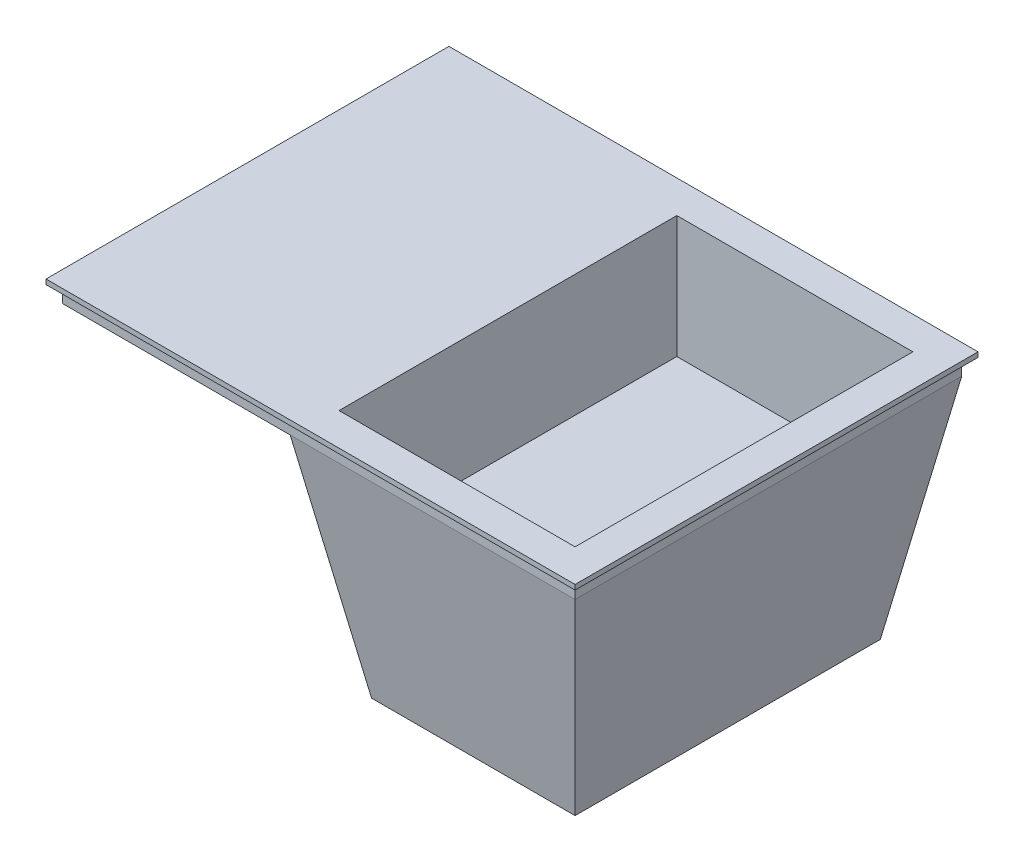
ISO-10303-21;
HEADER;
FILE_DESCRIPTION(('STEP AP214'),'2;1');
FILE_NAME('part.step','',(''),(''),'','','');
FILE_SCHEMA(('AUTOMOTIVE_DESIGN { 1 0 10303 214 1 1 1 1 }'));
ENDSEC;
DATA;
#1=APPLICATION_CONTEXT('core data for automotive mechanical design processes');
#2=APPLICATION_PROTOCOL_DEFINITION('international standard','automotive_design',2000,#1);
#3=PRODUCT_CONTEXT('',#1,'mechanical');
#4=PRODUCT('Part','Part','',(#3));
#5=PRODUCT_RELATED_PRODUCT_CATEGORY('part','',(#4));
#6=PRODUCT_DEFINITION_FORMATION('','',#4);
#7=PRODUCT_DEFINITION_CONTEXT('part definition',#1,'design');
#8=PRODUCT_DEFINITION('design','',#6,#7);
#9=PRODUCT_DEFINITION_SHAPE('','',#8);
#10=(LENGTH_UNIT() NAMED_UNIT(*) SI_UNIT(.MILLI.,.METRE.));
#11=(NAMED_UNIT(*) PLANE_ANGLE_UNIT() SI_UNIT($,.RADIAN.));
#12=(NAMED_UNIT(*) SI_UNIT($,.STERADIAN.) SOLID_ANGLE_UNIT());
#13=UNCERTAINTY_MEASURE_WITH_UNIT(LENGTH_MEASURE(1.E-05),#10,'distance_accuracy_value','');
#14=(GEOMETRIC_REPRESENTATION_CONTEXT(3) GLOBAL_UNCERTAINTY_ASSIGNED_CONTEXT((#13)) GLOBAL_UNIT_ASSIGNED_CONTEXT((#10,
#11,#12)) REPRESENTATION_CONTEXT('',''));
#15=CARTESIAN_POINT('',(0.,0.,0.));
#16=DIRECTION('',(0.,0.,1.));
#17=DIRECTION('',(1.,0.,0.));
#18=AXIS2_PLACEMENT_3D('',#15,#16,#17);
#19=CARTESIAN_POINT('',(-315.,300.,237.5));
#20=DIRECTION('',(1.,0.,0.));
#21=DIRECTION('',(0.,0.,-1.));
#22=AXIS2_PLACEMENT_3D('',#19,#20,#21);
#23=PLANE('',#22);
#24=DIRECTION('',(0.,-1.,0.));
#25=VECTOR('',#24,1.);
#26=CARTESIAN_POINT('',(-315.,300.,-237.5));
#27=LINE('',#26,#25);
#28=CARTESIAN_POINT('',(-315.,300.,-237.5));
#29=VERTEX_POINT('',#28);
#30=CARTESIAN_POINT('',(-315.,280.,-237.5));
#31=VERTEX_POINT('',#30);
#32=EDGE_CURVE('E260',#29,#31,#27,.T.);
#33=ORIENTED_EDGE('',*,*,#32,.T.);
#34=DIRECTION('',(0.,0.,1.));
#35=VECTOR('',#34,1.);
#36=CARTESIAN_POINT('',(-315.,280.,-237.5));
#37=LINE('',#36,#35);
#38=CARTESIAN_POINT('',(-315.,280.,237.5));
#39=VERTEX_POINT('',#38);
#40=EDGE_CURVE('E231',#31,#39,#37,.T.);
#41=ORIENTED_EDGE('',*,*,#40,.T.);
#42=DIRECTION('',(0.,-1.,0.));
#43=VECTOR('',#42,1.);
#44=CARTESIAN_POINT('',(-315.,300.,237.5));
#45=LINE('',#44,#43);
#46=CARTESIAN_POINT('',(-315.,300.,237.5));
#47=VERTEX_POINT('',#46);
#48=EDGE_CURVE('E269',#47,#39,#45,.T.);
#49=ORIENTED_EDGE('',*,*,#48,.F.);
#50=DIRECTION('',(0.,0.,1.));
#51=VECTOR('',#50,1.);
#52=CARTESIAN_POINT('',(-315.,300.,237.5));
#53=LINE('',#52,#51);
#54=EDGE_CURVE('E248',#29,#47,#53,.T.);
#55=ORIENTED_EDGE('',*,*,#54,.F.);
#56=EDGE_LOOP('',(#33,#41,#49,#55));
#57=FACE_BOUND('',#56,.T.);
#58=ADVANCED_FACE('F35',(#57),#23,.F.);
#59=CARTESIAN_POINT('',(315.,300.,237.5));
#60=DIRECTION('',(0.,0.,-1.));
#61=DIRECTION('',(-1.,0.,0.));
#62=AXIS2_PLACEMENT_3D('',#59,#60,#61);
#63=PLANE('',#62);
#64=DIRECTION('',(1.,0.,0.));
#65=VECTOR('',#64,1.);
#66=CARTESIAN_POINT('',(315.,280.,237.5));
#67=LINE('',#66,#65);
#68=CARTESIAN_POINT('',(-34.9999999999999,280.,237.5));
#69=VERTEX_POINT('',#68);
#70=EDGE_CURVE('E234',#39,#69,#67,.T.);
#71=ORIENTED_EDGE('',*,*,#70,.T.);
#72=DIRECTION('',(1.,0.,0.));
#73=VECTOR('',#72,1.);
#74=CARTESIAN_POINT('',(-325.,280.,237.5));
#75=LINE('',#74,#73);
#76=CARTESIAN_POINT('',(315.,280.,237.5));
#77=VERTEX_POINT('',#76);
#78=EDGE_CURVE('E184',#69,#77,#75,.T.);
#79=ORIENTED_EDGE('',*,*,#78,.T.);
#80=DIRECTION('',(0.,-1.,0.));
#81=VECTOR('',#80,1.);
#82=CARTESIAN_POINT('',(315.,300.,237.5));
#83=LINE('',#82,#81);
#84=CARTESIAN_POINT('',(315.,300.,237.5));
#85=VERTEX_POINT('',#84);
#86=EDGE_CURVE('E266',#85,#77,#83,.T.);
#87=ORIENTED_EDGE('',*,*,#86,.F.);
#88=DIRECTION('',(1.,0.,0.));
#89=VECTOR('',#88,1.);
#90=CARTESIAN_POINT('',(315.,300.,237.5));
#91=LINE('',#90,#89);
#92=EDGE_CURVE('E251',#47,#85,#91,.T.);
#93=ORIENTED_EDGE('',*,*,#92,.F.);
#94=ORIENTED_EDGE('',*,*,#48,.T.);
#95=EDGE_LOOP('',(#71,#79,#87,#93,#94));
#96=FACE_BOUND('',#95,.T.);
#97=ADVANCED_FACE('F278',(#96),#63,.F.);
#98=CARTESIAN_POINT('',(315.,300.,237.5));
#99=DIRECTION('',(-1.,0.,0.));
#100=DIRECTION('',(0.,0.,1.));
#101=AXIS2_PLACEMENT_3D('',#98,#99,#100);
#102=PLANE('',#101);
#103=ORIENTED_EDGE('',*,*,#86,.T.);
#104=DIRECTION('',(0.,0.,1.));
#105=VECTOR('',#104,1.);
#106=CARTESIAN_POINT('',(315.,280.,-237.5));
#107=LINE('',#106,#105);
#108=CARTESIAN_POINT('',(315.,280.,-237.5));
#109=VERTEX_POINT('',#108);
#110=EDGE_CURVE('E225',#109,#77,#107,.T.);
#111=ORIENTED_EDGE('',*,*,#110,.F.);
#112=DIRECTION('',(0.,-1.,0.));
#113=VECTOR('',#112,1.);
#114=CARTESIAN_POINT('',(315.,300.,-237.5));
#115=LINE('',#114,#113);
#116=CARTESIAN_POINT('',(315.,300.,-237.5));
#117=VERTEX_POINT('',#116);
#118=EDGE_CURVE('E263',#117,#109,#115,.T.);
#119=ORIENTED_EDGE('',*,*,#118,.F.);
#120=DIRECTION('',(0.,0.,-1.));
#121=VECTOR('',#120,1.);
#122=CARTESIAN_POINT('',(315.,300.,237.5));
#123=LINE('',#122,#121);
#124=EDGE_CURVE('E254',#85,#117,#123,.T.);
#125=ORIENTED_EDGE('',*,*,#124,.F.);
#126=EDGE_LOOP('',(#103,#111,#119,#125));
#127=FACE_BOUND('',#126,.T.);
#128=ADVANCED_FACE('F304',(#127),#102,.F.);
#129=CARTESIAN_POINT('',(315.,300.,-237.5));
#130=DIRECTION('',(0.,0.,1.));
#131=DIRECTION('',(1.,0.,0.));
#132=AXIS2_PLACEMENT_3D('',#129,#130,#131);
#133=PLANE('',#132);
#134=ORIENTED_EDGE('',*,*,#118,.T.);
#135=DIRECTION('',(1.,0.,0.));
#136=VECTOR('',#135,1.);
#137=CARTESIAN_POINT('',(-325.,280.,-237.5));
#138=LINE('',#137,#136);
#139=CARTESIAN_POINT('',(-35.,280.,-237.5));
#140=VERTEX_POINT('',#139);
#141=EDGE_CURVE('E289',#140,#109,#138,.T.);
#142=ORIENTED_EDGE('',*,*,#141,.F.);
#143=DIRECTION('',(-1.,0.,0.));
#144=VECTOR('',#143,1.);
#145=CARTESIAN_POINT('',(-315.,280.,-237.5));
#146=LINE('',#145,#144);
#147=EDGE_CURVE('E226',#140,#31,#146,.T.);
#148=ORIENTED_EDGE('',*,*,#147,.T.);
#149=ORIENTED_EDGE('',*,*,#32,.F.);
#150=DIRECTION('',(-1.,0.,0.));
#151=VECTOR('',#150,1.);
#152=CARTESIAN_POINT('',(315.,300.,-237.5));
#153=LINE('',#152,#151);
#154=EDGE_CURVE('E257',#117,#29,#153,.T.);
#155=ORIENTED_EDGE('',*,*,#154,.F.);
#156=EDGE_LOOP('',(#134,#142,#148,#149,#155));
#157=FACE_BOUND('',#156,.T.);
#158=ADVANCED_FACE('F286',(#157),#133,.F.);
#159=CARTESIAN_POINT('',(0.,0.,0.));
#160=DIRECTION('',(0.,1.,0.));
#161=DIRECTION('',(0.,0.,1.));
#162=AXIS2_PLACEMENT_3D('',#159,#160,#161);
#163=PLANE('',#162);
#164=DIRECTION('',(0.,0.,1.));
#165=VECTOR('',#164,1.);
#166=CARTESIAN_POINT('',(265.,0.,-237.5));
#167=LINE('',#166,#165);
#168=CARTESIAN_POINT('',(265.,0.,-187.5));
#169=VERTEX_POINT('',#168);
#170=CARTESIAN_POINT('',(265.,0.,187.5));
#171=VERTEX_POINT('',#170);
#172=EDGE_CURVE('E230',#169,#171,#167,.T.);
#173=ORIENTED_EDGE('',*,*,#172,.T.);
#174=DIRECTION('',(1.,0.,0.));
#175=VECTOR('',#174,1.);
#176=CARTESIAN_POINT('',(-325.,0.,187.5));
#177=LINE('',#176,#175);
#178=CARTESIAN_POINT('',(15.0000000000001,0.,187.5));
#179=VERTEX_POINT('',#178);
#180=EDGE_CURVE('E181',#179,#171,#177,.T.);
#181=ORIENTED_EDGE('',*,*,#180,.F.);
#182=DIRECTION('',(0.,0.,1.));
#183=VECTOR('',#182,1.);
#184=CARTESIAN_POINT('',(15.0000000000001,0.,-237.5));
#185=LINE('',#184,#183);
#186=CARTESIAN_POINT('',(15.0000000000001,0.,-187.5));
#187=VERTEX_POINT('',#186);
#188=EDGE_CURVE('E229',#187,#179,#185,.T.);
#189=ORIENTED_EDGE('',*,*,#188,.F.);
#190=DIRECTION('',(1.,0.,0.));
#191=VECTOR('',#190,1.);
#192=CARTESIAN_POINT('',(-325.,0.,-187.5));
#193=LINE('',#192,#191);
#194=EDGE_CURVE('E57',#187,#169,#193,.T.);
#195=ORIENTED_EDGE('',*,*,#194,.T.);
#196=EDGE_LOOP('',(#173,#181,#189,#195));
#197=FACE_BOUND('',#196,.T.);
#198=ADVANCED_FACE('F297',(#197),#163,.F.);
#199=CARTESIAN_POINT('',(315.,280.,-237.5));
#200=DIRECTION('',(-0.984427575508482,0.175790638483657,0.));
#201=DIRECTION('',(-0.175790638483657,-0.984427575508482,0.));
#202=AXIS2_PLACEMENT_3D('',#199,#200,#201);
#203=PLANE('',#202);
#204=ORIENTED_EDGE('',*,*,#110,.T.);
#205=DIRECTION('',(-0.173135840266111,-0.969560705490221,-0.173135840266111));
#206=VECTOR('',#205,1.);
#207=CARTESIAN_POINT('',(300.76139088729,200.263788968825,223.26139088729));
#208=LINE('',#207,#206);
#209=EDGE_CURVE('E190',#77,#171,#208,.T.);
#210=ORIENTED_EDGE('',*,*,#209,.T.);
#211=ORIENTED_EDGE('',*,*,#172,.F.);
#212=DIRECTION('',(0.173135840266111,0.969560705490221,-0.173135840266111));
#213=VECTOR('',#212,1.);
#214=CARTESIAN_POINT('',(315.,280.,-237.5));
#215=LINE('',#214,#213);
#216=EDGE_CURVE('E188',#169,#109,#215,.T.);
#217=ORIENTED_EDGE('',*,*,#216,.T.);
#218=EDGE_LOOP('',(#204,#210,#211,#217));
#219=FACE_BOUND('',#218,.T.);
#220=ADVANCED_FACE('F301',(#219),#203,.F.);
#221=CARTESIAN_POINT('',(-315.,280.,-237.5));
#222=DIRECTION('',(0.,1.,0.));
#223=DIRECTION('',(0.,0.,1.));
#224=AXIS2_PLACEMENT_3D('',#221,#222,#223);
#225=PLANE('',#224);
#226=ORIENTED_EDGE('',*,*,#40,.F.);
#227=ORIENTED_EDGE('',*,*,#147,.F.);
#228=DIRECTION('',(0.,0.,1.));
#229=VECTOR('',#228,1.);
#230=CARTESIAN_POINT('',(-34.9999999999999,280.,-237.5));
#231=LINE('',#230,#229);
#232=EDGE_CURVE('E235',#140,#69,#231,.T.);
#233=ORIENTED_EDGE('',*,*,#232,.T.);
#234=ORIENTED_EDGE('',*,*,#70,.F.);
#235=EDGE_LOOP('',(#226,#227,#233,#234));
#236=FACE_BOUND('',#235,.T.);
#237=ADVANCED_FACE('F291',(#236),#225,.F.);
#238=CARTESIAN_POINT('',(15.0000000000001,0.,-237.5));
#239=DIRECTION('',(0.984427575508482,0.175790638483658,0.));
#240=DIRECTION('',(-0.175790638483658,0.984427575508482,0.));
#241=AXIS2_PLACEMENT_3D('',#238,#239,#240);
#242=PLANE('',#241);
#243=ORIENTED_EDGE('',*,*,#188,.T.);
#244=DIRECTION('',(-0.173135840266111,0.969560705490221,0.173135840266111));
#245=VECTOR('',#244,1.);
#246=CARTESIAN_POINT('',(27.7398081534773,-71.3429256594724,174.760191846523));
#247=LINE('',#246,#245);
#248=EDGE_CURVE('E11',#179,#69,#247,.T.);
#249=ORIENTED_EDGE('',*,*,#248,.T.);
#250=ORIENTED_EDGE('',*,*,#232,.F.);
#251=DIRECTION('',(0.173135840266111,-0.969560705490221,0.173135840266111));
#252=VECTOR('',#251,1.);
#253=CARTESIAN_POINT('',(13.5011990407675,8.39328537170262,-188.998800959233));
#254=LINE('',#253,#252);
#255=EDGE_CURVE('E42',#140,#187,#254,.T.);
#256=ORIENTED_EDGE('',*,*,#255,.T.);
#257=EDGE_LOOP('',(#243,#249,#250,#256));
#258=FACE_BOUND('',#257,.T.);
#259=ADVANCED_FACE('F292',(#258),#242,.F.);
#260=CARTESIAN_POINT('',(0.,300.,0.));
#261=DIRECTION('',(0.,1.,0.));
#262=DIRECTION('',(0.,0.,1.));
#263=AXIS2_PLACEMENT_3D('',#260,#261,#262);
#264=PLANE('',#263);
#265=DIRECTION('',(-1.,0.,0.));
#266=VECTOR('',#265,1.);
#267=CARTESIAN_POINT('',(325.,300.,-247.5));
#268=LINE('',#267,#266);
#269=CARTESIAN_POINT('',(325.,300.,-247.5));
#270=VERTEX_POINT('',#269);
#271=CARTESIAN_POINT('',(-325.,300.,-247.5));
#272=VERTEX_POINT('',#271);
#273=EDGE_CURVE('E193',#270,#272,#268,.T.);
#274=ORIENTED_EDGE('',*,*,#273,.F.);
#275=DIRECTION('',(0.,0.,-1.));
#276=VECTOR('',#275,1.);
#277=CARTESIAN_POINT('',(325.,300.,247.5));
#278=LINE('',#277,#276);
#279=CARTESIAN_POINT('',(325.,300.,247.5));
#280=VERTEX_POINT('',#279);
#281=EDGE_CURVE('E200',#280,#270,#278,.T.);
#282=ORIENTED_EDGE('',*,*,#281,.F.);
#283=DIRECTION('',(1.,0.,0.));
#284=VECTOR('',#283,1.);
#285=CARTESIAN_POINT('',(-325.,300.,247.5));
#286=LINE('',#285,#284);
#287=CARTESIAN_POINT('',(-325.,300.,247.5));
#288=VERTEX_POINT('',#287);
#289=EDGE_CURVE('E211',#288,#280,#286,.T.);
#290=ORIENTED_EDGE('',*,*,#289,.F.);
#291=DIRECTION('',(0.,0.,1.));
#292=VECTOR('',#291,1.);
#293=CARTESIAN_POINT('',(-325.,300.,-247.5));
#294=LINE('',#293,#292);
#295=EDGE_CURVE('E209',#272,#288,#294,.T.);
#296=ORIENTED_EDGE('',*,*,#295,.F.);
#297=EDGE_LOOP('',(#274,#282,#290,#296));
#298=FACE_BOUND('',#297,.T.);
#299=ORIENTED_EDGE('',*,*,#154,.T.);
#300=ORIENTED_EDGE('',*,*,#54,.T.);
#301=ORIENTED_EDGE('',*,*,#92,.T.);
#302=ORIENTED_EDGE('',*,*,#124,.T.);
#303=EDGE_LOOP('',(#299,#300,#301,#302));
#304=FACE_BOUND('',#303,.T.);
#305=ADVANCED_FACE('F282',(#298,#304),#264,.F.);
#306=CARTESIAN_POINT('',(325.,306.,-247.5));
#307=DIRECTION('',(0.,0.,1.));
#308=DIRECTION('',(1.,0.,0.));
#309=AXIS2_PLACEMENT_3D('',#306,#307,#308);
#310=PLANE('',#309);
#311=ORIENTED_EDGE('',*,*,#273,.T.);
#312=DIRECTION('',(0.,-1.,0.));
#313=VECTOR('',#312,1.);
#314=CARTESIAN_POINT('',(-325.,306.,-247.5));
#315=LINE('',#314,#313);
#316=CARTESIAN_POINT('',(-325.,306.,-247.5));
#317=VERTEX_POINT('',#316);
#318=EDGE_CURVE('E222',#317,#272,#315,.T.);
#319=ORIENTED_EDGE('',*,*,#318,.F.);
#320=DIRECTION('',(-1.,0.,0.));
#321=VECTOR('',#320,1.);
#322=CARTESIAN_POINT('',(325.,306.,-247.5));
#323=LINE('',#322,#321);
#324=CARTESIAN_POINT('',(325.,306.,-247.5));
#325=VERTEX_POINT('',#324);
#326=EDGE_CURVE('E196',#325,#317,#323,.T.);
#327=ORIENTED_EDGE('',*,*,#326,.F.);
#328=DIRECTION('',(0.,-1.,0.));
#329=VECTOR('',#328,1.);
#330=CARTESIAN_POINT('',(325.,306.,-247.5));
#331=LINE('',#330,#329);
#332=EDGE_CURVE('E206',#325,#270,#331,.T.);
#333=ORIENTED_EDGE('',*,*,#332,.T.);
#334=EDGE_LOOP('',(#311,#319,#327,#333));
#335=FACE_BOUND('',#334,.T.);
#336=ADVANCED_FACE('F447',(#335),#310,.F.);
#337=CARTESIAN_POINT('',(-325.,306.,-247.5));
#338=DIRECTION('',(1.,0.,0.));
#339=DIRECTION('',(0.,0.,-1.));
#340=AXIS2_PLACEMENT_3D('',#337,#338,#339);
#341=PLANE('',#340);
#342=ORIENTED_EDGE('',*,*,#295,.T.);
#343=DIRECTION('',(0.,-1.,0.));
#344=VECTOR('',#343,1.);
#345=CARTESIAN_POINT('',(-325.,306.,247.5));
#346=LINE('',#345,#344);
#347=CARTESIAN_POINT('',(-325.,306.,247.5));
#348=VERTEX_POINT('',#347);
#349=EDGE_CURVE('E219',#348,#288,#346,.T.);
#350=ORIENTED_EDGE('',*,*,#349,.F.);
#351=DIRECTION('',(0.,0.,1.));
#352=VECTOR('',#351,1.);
#353=CARTESIAN_POINT('',(-325.,306.,-247.5));
#354=LINE('',#353,#352);
#355=EDGE_CURVE('E199',#317,#348,#354,.T.);
#356=ORIENTED_EDGE('',*,*,#355,.F.);
#357=ORIENTED_EDGE('',*,*,#318,.T.);
#358=EDGE_LOOP('',(#342,#350,#356,#357));
#359=FACE_BOUND('',#358,.T.);
#360=ADVANCED_FACE('F454',(#359),#341,.F.);
#361=CARTESIAN_POINT('',(-325.,306.,247.5));
#362=DIRECTION('',(0.,0.,-1.));
#363=DIRECTION('',(-1.,0.,0.));
#364=AXIS2_PLACEMENT_3D('',#361,#362,#363);
#365=PLANE('',#364);
#366=ORIENTED_EDGE('',*,*,#289,.T.);
#367=DIRECTION('',(0.,-1.,0.));
#368=VECTOR('',#367,1.);
#369=CARTESIAN_POINT('',(325.,306.,247.5));
#370=LINE('',#369,#368);
#371=CARTESIAN_POINT('',(325.,306.,247.5));
#372=VERTEX_POINT('',#371);
#373=EDGE_CURVE('E216',#372,#280,#370,.T.);
#374=ORIENTED_EDGE('',*,*,#373,.F.);
#375=DIRECTION('',(1.,0.,0.));
#376=VECTOR('',#375,1.);
#377=CARTESIAN_POINT('',(-325.,306.,247.5));
#378=LINE('',#377,#376);
#379=EDGE_CURVE('E202',#348,#372,#378,.T.);
#380=ORIENTED_EDGE('',*,*,#379,.F.);
#381=ORIENTED_EDGE('',*,*,#349,.T.);
#382=EDGE_LOOP('',(#366,#374,#380,#381));
#383=FACE_BOUND('',#382,.T.);
#384=ADVANCED_FACE('F450',(#383),#365,.F.);
#385=CARTESIAN_POINT('',(325.,306.,247.5));
#386=DIRECTION('',(-1.,0.,0.));
#387=DIRECTION('',(0.,0.,1.));
#388=AXIS2_PLACEMENT_3D('',#385,#386,#387);
#389=PLANE('',#388);
#390=ORIENTED_EDGE('',*,*,#281,.T.);
#391=ORIENTED_EDGE('',*,*,#332,.F.);
#392=DIRECTION('',(0.,0.,-1.));
#393=VECTOR('',#392,1.);
#394=CARTESIAN_POINT('',(325.,306.,247.5));
#395=LINE('',#394,#393);
#396=EDGE_CURVE('E204',#372,#325,#395,.T.);
#397=ORIENTED_EDGE('',*,*,#396,.F.);
#398=ORIENTED_EDGE('',*,*,#373,.T.);
#399=EDGE_LOOP('',(#390,#391,#397,#398));
#400=FACE_BOUND('',#399,.T.);
#401=ADVANCED_FACE('F326',(#400),#389,.F.);
#402=CARTESIAN_POINT('',(0.,306.,0.));
#403=DIRECTION('',(0.,1.,0.));
#404=DIRECTION('',(0.,0.,1.));
#405=AXIS2_PLACEMENT_3D('',#402,#403,#404);
#406=PLANE('',#405);
#407=DIRECTION('',(0.,0.,1.));
#408=VECTOR('',#407,1.);
#409=CARTESIAN_POINT('',(-4.99999999999989,306.,207.5));
#410=LINE('',#409,#408);
#411=CARTESIAN_POINT('',(-4.99999999999989,306.,-207.5));
#412=VERTEX_POINT('',#411);
#413=CARTESIAN_POINT('',(-4.99999999999989,306.,207.5));
#414=VERTEX_POINT('',#413);
#415=EDGE_CURVE('E49',#412,#414,#410,.T.);
#416=ORIENTED_EDGE('',*,*,#415,.F.);
#417=DIRECTION('',(-1.,0.,0.));
#418=VECTOR('',#417,1.);
#419=CARTESIAN_POINT('',(-4.99999999999989,306.,-207.5));
#420=LINE('',#419,#418);
#421=CARTESIAN_POINT('',(285.,306.,-207.5));
#422=VERTEX_POINT('',#421);
#423=EDGE_CURVE('E161',#422,#412,#420,.T.);
#424=ORIENTED_EDGE('',*,*,#423,.F.);
#425=DIRECTION('',(0.,0.,-1.));
#426=VECTOR('',#425,1.);
#427=CARTESIAN_POINT('',(285.,306.,207.5));
#428=LINE('',#427,#426);
#429=CARTESIAN_POINT('',(285.,306.,207.5));
#430=VERTEX_POINT('',#429);
#431=EDGE_CURVE('E164',#430,#422,#428,.T.);
#432=ORIENTED_EDGE('',*,*,#431,.F.);
#433=DIRECTION('',(1.,0.,0.));
#434=VECTOR('',#433,1.);
#435=CARTESIAN_POINT('',(-4.99999999999989,306.,207.5));
#436=LINE('',#435,#434);
#437=EDGE_CURVE('E170',#414,#430,#436,.T.);
#438=ORIENTED_EDGE('',*,*,#437,.F.);
#439=EDGE_LOOP('',(#416,#424,#432,#438));
#440=FACE_BOUND('',#439,.T.);
#441=ORIENTED_EDGE('',*,*,#326,.T.);
#442=ORIENTED_EDGE('',*,*,#355,.T.);
#443=ORIENTED_EDGE('',*,*,#379,.T.);
#444=ORIENTED_EDGE('',*,*,#396,.T.);
#445=EDGE_LOOP('',(#441,#442,#443,#444));
#446=FACE_BOUND('',#445,.T.);
#447=ADVANCED_FACE('F380',(#440,#446),#406,.T.);
#448=CARTESIAN_POINT('',(-325.,0.,-187.5));
#449=DIRECTION('',(0.,0.175790638483657,0.984427575508482));
#450=DIRECTION('',(0.,-0.984427575508482,0.175790638483657));
#451=AXIS2_PLACEMENT_3D('',#448,#449,#450);
#452=PLANE('',#451);
#453=ORIENTED_EDGE('',*,*,#194,.F.);
#454=ORIENTED_EDGE('',*,*,#255,.F.);
#455=ORIENTED_EDGE('',*,*,#141,.T.);
#456=ORIENTED_EDGE('',*,*,#216,.F.);
#457=EDGE_LOOP('',(#453,#454,#455,#456));
#458=FACE_BOUND('',#457,.T.);
#459=ADVANCED_FACE('F375',(#458),#452,.F.);
#460=CARTESIAN_POINT('',(-325.,280.,237.5));
#461=DIRECTION('',(0.,0.175790638483657,-0.984427575508482));
#462=DIRECTION('',(0.,0.984427575508482,0.175790638483657));
#463=AXIS2_PLACEMENT_3D('',#460,#461,#462);
#464=PLANE('',#463);
#465=ORIENTED_EDGE('',*,*,#78,.F.);
#466=ORIENTED_EDGE('',*,*,#248,.F.);
#467=ORIENTED_EDGE('',*,*,#180,.T.);
#468=ORIENTED_EDGE('',*,*,#209,.F.);
#469=EDGE_LOOP('',(#465,#466,#467,#468));
#470=FACE_BOUND('',#469,.T.);
#471=ADVANCED_FACE('F295',(#470),#464,.F.);
#472=CARTESIAN_POINT('',(-4.99999999999989,156.,207.5));
#473=DIRECTION('',(-1.,0.,0.));
#474=DIRECTION('',(0.,0.,1.));
#475=AXIS2_PLACEMENT_3D('',#472,#473,#474);
#476=PLANE('',#475);
#477=ORIENTED_EDGE('',*,*,#415,.T.);
#478=DIRECTION('',(0.,1.,0.));
#479=VECTOR('',#478,1.);
#480=CARTESIAN_POINT('',(-4.99999999999989,156.,207.5));
#481=LINE('',#480,#479);
#482=CARTESIAN_POINT('',(-4.99999999999989,156.,207.5));
#483=VERTEX_POINT('',#482);
#484=EDGE_CURVE('E139',#483,#414,#481,.T.);
#485=ORIENTED_EDGE('',*,*,#484,.F.);
#486=DIRECTION('',(0.,0.,1.));
#487=VECTOR('',#486,1.);
#488=CARTESIAN_POINT('',(-4.99999999999989,156.,207.5));
#489=LINE('',#488,#487);
#490=CARTESIAN_POINT('',(-4.99999999999989,156.,-207.5));
#491=VERTEX_POINT('',#490);
#492=EDGE_CURVE('E143',#491,#483,#489,.T.);
#493=ORIENTED_EDGE('',*,*,#492,.F.);
#494=DIRECTION('',(0.,1.,0.));
#495=VECTOR('',#494,1.);
#496=CARTESIAN_POINT('',(-4.99999999999989,156.,-207.5));
#497=LINE('',#496,#495);
#498=EDGE_CURVE('E174',#491,#412,#497,.T.);
#499=ORIENTED_EDGE('',*,*,#498,.T.);
#500=EDGE_LOOP('',(#477,#485,#493,#499));
#501=FACE_BOUND('',#500,.T.);
#502=ADVANCED_FACE('F141',(#501),#476,.F.);
#503=CARTESIAN_POINT('',(-4.99999999999989,156.,-207.5));
#504=DIRECTION('',(0.,0.,-1.));
#505=DIRECTION('',(-1.,0.,0.));
#506=AXIS2_PLACEMENT_3D('',#503,#504,#505);
#507=PLANE('',#506);
#508=ORIENTED_EDGE('',*,*,#423,.T.);
#509=ORIENTED_EDGE('',*,*,#498,.F.);
#510=DIRECTION('',(-1.,0.,0.));
#511=VECTOR('',#510,1.);
#512=CARTESIAN_POINT('',(-4.99999999999989,156.,-207.5));
#513=LINE('',#512,#511);
#514=CARTESIAN_POINT('',(285.,156.,-207.5));
#515=VERTEX_POINT('',#514);
#516=EDGE_CURVE('E149',#515,#491,#513,.T.);
#517=ORIENTED_EDGE('',*,*,#516,.F.);
#518=DIRECTION('',(0.,1.,0.));
#519=VECTOR('',#518,1.);
#520=CARTESIAN_POINT('',(285.,156.,-207.5));
#521=LINE('',#520,#519);
#522=EDGE_CURVE('E176',#515,#422,#521,.T.);
#523=ORIENTED_EDGE('',*,*,#522,.T.);
#524=EDGE_LOOP('',(#508,#509,#517,#523));
#525=FACE_BOUND('',#524,.T.);
#526=ADVANCED_FACE('F406',(#525),#507,.F.);
#527=CARTESIAN_POINT('',(285.,156.,207.5));
#528=DIRECTION('',(1.,0.,0.));
#529=DIRECTION('',(0.,0.,-1.));
#530=AXIS2_PLACEMENT_3D('',#527,#528,#529);
#531=PLANE('',#530);
#532=ORIENTED_EDGE('',*,*,#431,.T.);
#533=ORIENTED_EDGE('',*,*,#522,.F.);
#534=DIRECTION('',(0.,0.,-1.));
#535=VECTOR('',#534,1.);
#536=CARTESIAN_POINT('',(285.,156.,207.5));
#537=LINE('',#536,#535);
#538=CARTESIAN_POINT('',(285.,156.,207.5));
#539=VERTEX_POINT('',#538);
#540=EDGE_CURVE('E157',#539,#515,#537,.T.);
#541=ORIENTED_EDGE('',*,*,#540,.F.);
#542=DIRECTION('',(0.,1.,0.));
#543=VECTOR('',#542,1.);
#544=CARTESIAN_POINT('',(285.,156.,207.5));
#545=LINE('',#544,#543);
#546=EDGE_CURVE('E148',#539,#430,#545,.T.);
#547=ORIENTED_EDGE('',*,*,#546,.T.);
#548=EDGE_LOOP('',(#532,#533,#541,#547));
#549=FACE_BOUND('',#548,.T.);
#550=ADVANCED_FACE('F415',(#549),#531,.F.);
#551=CARTESIAN_POINT('',(-4.99999999999989,156.,207.5));
#552=DIRECTION('',(0.,0.,1.));
#553=DIRECTION('',(1.,0.,0.));
#554=AXIS2_PLACEMENT_3D('',#551,#552,#553);
#555=PLANE('',#554);
#556=ORIENTED_EDGE('',*,*,#437,.T.);
#557=ORIENTED_EDGE('',*,*,#546,.F.);
#558=DIRECTION('',(1.,0.,0.));
#559=VECTOR('',#558,1.);
#560=CARTESIAN_POINT('',(-4.99999999999989,156.,207.5));
#561=LINE('',#560,#559);
#562=EDGE_CURVE('E152',#483,#539,#561,.T.);
#563=ORIENTED_EDGE('',*,*,#562,.F.);
#564=ORIENTED_EDGE('',*,*,#484,.T.);
#565=EDGE_LOOP('',(#556,#557,#563,#564));
#566=FACE_BOUND('',#565,.T.);
#567=ADVANCED_FACE('F153',(#566),#555,.F.);
#568=CARTESIAN_POINT('',(0.,156.,0.));
#569=DIRECTION('',(0.,-1.,0.));
#570=DIRECTION('',(0.,0.,-1.));
#571=AXIS2_PLACEMENT_3D('',#568,#569,#570);
#572=PLANE('',#571);
#573=ORIENTED_EDGE('',*,*,#492,.T.);
#574=ORIENTED_EDGE('',*,*,#562,.T.);
#575=ORIENTED_EDGE('',*,*,#540,.T.);
#576=ORIENTED_EDGE('',*,*,#516,.T.);
#577=EDGE_LOOP('',(#573,#574,#575,#576));
#578=FACE_BOUND('',#577,.T.);
#579=ADVANCED_FACE('F159',(#578),#572,.F.);
#580=CLOSED_SHELL('',(#58,#97,#128,#158,#198,#220,#237,#259,#305,#336,#360,#384,#401,#447,#459,
#471,#502,#526,#550,#567,#579));
#581=MANIFOLD_SOLID_BREP('B2',#580);
#582=ADVANCED_BREP_SHAPE_REPRESENTATION('',(#18,#581),#14);
#583=SHAPE_DEFINITION_REPRESENTATION(#9,#582);
ENDSEC;
END-ISO-10303-21;
